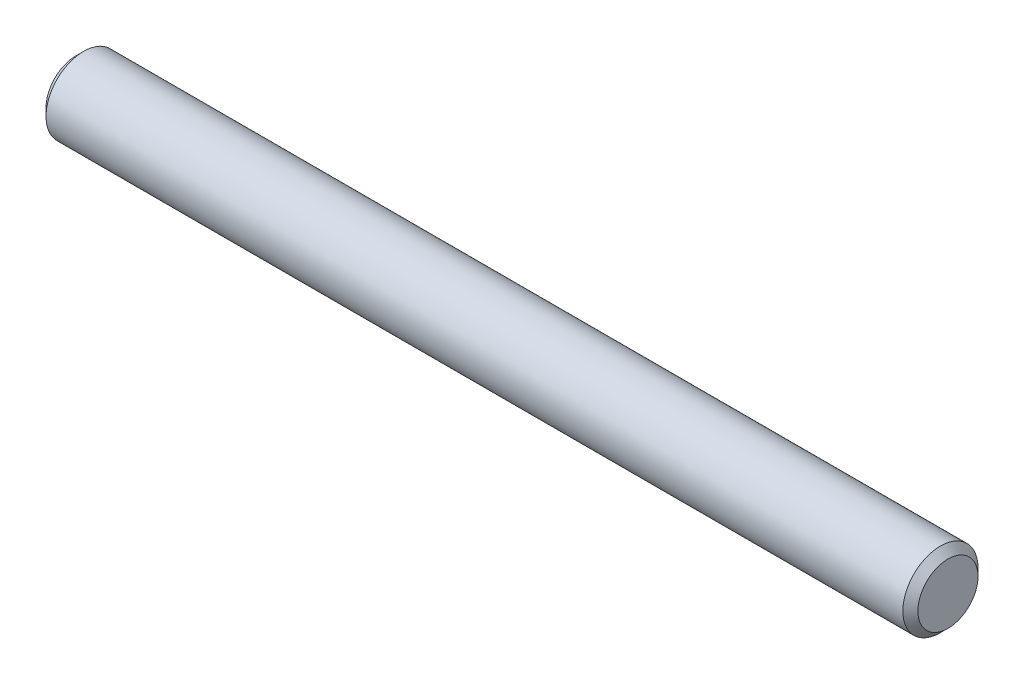
ISO-10303-21;
HEADER;
FILE_DESCRIPTION(('STEP AP214'),'2;1');
FILE_NAME('part.step','',(''),(''),'','','');
FILE_SCHEMA(('AUTOMOTIVE_DESIGN { 1 0 10303 214 1 1 1 1 }'));
ENDSEC;
DATA;
#1=APPLICATION_CONTEXT('core data for automotive mechanical design processes');
#2=APPLICATION_PROTOCOL_DEFINITION('international standard','automotive_design',2000,#1);
#3=PRODUCT_CONTEXT('',#1,'mechanical');
#4=PRODUCT('Part','Part','',(#3));
#5=PRODUCT_RELATED_PRODUCT_CATEGORY('part','',(#4));
#6=PRODUCT_DEFINITION_FORMATION('','',#4);
#7=PRODUCT_DEFINITION_CONTEXT('part definition',#1,'design');
#8=PRODUCT_DEFINITION('design','',#6,#7);
#9=PRODUCT_DEFINITION_SHAPE('','',#8);
#10=(LENGTH_UNIT() NAMED_UNIT(*) SI_UNIT(.MILLI.,.METRE.));
#11=(NAMED_UNIT(*) PLANE_ANGLE_UNIT() SI_UNIT($,.RADIAN.));
#12=(NAMED_UNIT(*) SI_UNIT($,.STERADIAN.) SOLID_ANGLE_UNIT());
#13=UNCERTAINTY_MEASURE_WITH_UNIT(LENGTH_MEASURE(1.E-05),#10,'distance_accuracy_value','');
#14=(GEOMETRIC_REPRESENTATION_CONTEXT(3) GLOBAL_UNCERTAINTY_ASSIGNED_CONTEXT((#13)) GLOBAL_UNIT_ASSIGNED_CONTEXT((#10,
#11,#12)) REPRESENTATION_CONTEXT('',''));
#15=CARTESIAN_POINT('',(0.,0.,0.));
#16=DIRECTION('',(0.,0.,1.));
#17=DIRECTION('',(1.,0.,0.));
#18=AXIS2_PLACEMENT_3D('',#15,#16,#17);
#19=CARTESIAN_POINT('',(116.,0.,0.));
#20=DIRECTION('',(-1.,0.,0.));
#21=DIRECTION('',(0.,0.,1.));
#22=AXIS2_PLACEMENT_3D('',#19,#20,#21);
#23=CYLINDRICAL_SURFACE('',#22,5.);
#24=CARTESIAN_POINT('',(115.,0.,0.));
#25=DIRECTION('',(1.,0.,0.));
#26=DIRECTION('',(0.,0.,-1.));
#27=AXIS2_PLACEMENT_3D('',#24,#25,#26);
#28=CIRCLE('',#27,5.);
#29=CARTESIAN_POINT('',(115.,0.,-5.));
#30=VERTEX_POINT('',#29);
#31=EDGE_CURVE('E38',#30,#30,#28,.F.);
#32=ORIENTED_EDGE('',*,*,#31,.T.);
#33=EDGE_LOOP('',(#32));
#34=FACE_BOUND('',#33,.T.);
#35=CARTESIAN_POINT('',(1.00000000000006,0.,0.));
#36=DIRECTION('',(1.,0.,0.));
#37=DIRECTION('',(0.,0.,-1.));
#38=AXIS2_PLACEMENT_3D('',#35,#36,#37);
#39=CIRCLE('',#38,5.);
#40=CARTESIAN_POINT('',(1.00000000000006,0.,-5.));
#41=VERTEX_POINT('',#40);
#42=EDGE_CURVE('E42',#41,#41,#39,.T.);
#43=ORIENTED_EDGE('',*,*,#42,.T.);
#44=EDGE_LOOP('',(#43));
#45=FACE_BOUND('',#44,.T.);
#46=ADVANCED_FACE('F31',(#34,#45),#23,.T.);
#47=CARTESIAN_POINT('',(116.,0.,0.));
#48=DIRECTION('',(1.,0.,0.));
#49=DIRECTION('',(0.,0.,-1.));
#50=AXIS2_PLACEMENT_3D('',#47,#48,#49);
#51=PLANE('',#50);
#52=CARTESIAN_POINT('',(116.,0.,0.));
#53=DIRECTION('',(1.,0.,0.));
#54=DIRECTION('',(0.,0.,-1.));
#55=AXIS2_PLACEMENT_3D('',#52,#53,#54);
#56=CIRCLE('',#55,4.00000000000003);
#57=CARTESIAN_POINT('',(116.,0.,-4.00000000000003));
#58=VERTEX_POINT('',#57);
#59=EDGE_CURVE('E46',#58,#58,#56,.T.);
#60=ORIENTED_EDGE('',*,*,#59,.T.);
#61=EDGE_LOOP('',(#60));
#62=FACE_BOUND('',#61,.T.);
#63=ADVANCED_FACE('F52',(#62),#51,.T.);
#64=CARTESIAN_POINT('',(0.,0.,0.));
#65=DIRECTION('',(1.,0.,0.));
#66=DIRECTION('',(0.,0.,-1.));
#67=AXIS2_PLACEMENT_3D('',#64,#65,#66);
#68=PLANE('',#67);
#69=CARTESIAN_POINT('',(0.,0.,0.));
#70=DIRECTION('',(1.,0.,0.));
#71=DIRECTION('',(0.,0.,-1.));
#72=AXIS2_PLACEMENT_3D('',#69,#70,#71);
#73=CIRCLE('',#72,3.99999999999993);
#74=CARTESIAN_POINT('',(0.,0.,-3.99999999999993));
#75=VERTEX_POINT('',#74);
#76=EDGE_CURVE('E10',#75,#75,#73,.F.);
#77=ORIENTED_EDGE('',*,*,#76,.T.);
#78=EDGE_LOOP('',(#77));
#79=FACE_BOUND('',#78,.T.);
#80=ADVANCED_FACE('F56',(#79),#68,.F.);
#81=CARTESIAN_POINT('',(116.,0.,0.));
#82=DIRECTION('',(-1.,0.,0.));
#83=DIRECTION('',(0.,0.,1.));
#84=AXIS2_PLACEMENT_3D('',#81,#82,#83);
#85=CONICAL_SURFACE('',#84,4.00000000000003,0.785398163397446);
#86=ORIENTED_EDGE('',*,*,#31,.F.);
#87=EDGE_LOOP('',(#86));
#88=FACE_BOUND('',#87,.T.);
#89=ORIENTED_EDGE('',*,*,#59,.F.);
#90=EDGE_LOOP('',(#89));
#91=FACE_BOUND('',#90,.T.);
#92=ADVANCED_FACE('F54',(#88,#91),#85,.T.);
#93=CARTESIAN_POINT('',(1.00000000000006,0.,0.));
#94=DIRECTION('',(1.,0.,0.));
#95=DIRECTION('',(0.,0.,-1.));
#96=AXIS2_PLACEMENT_3D('',#93,#94,#95);
#97=CONICAL_SURFACE('',#96,5.,0.785398163397453);
#98=ORIENTED_EDGE('',*,*,#76,.F.);
#99=EDGE_LOOP('',(#98));
#100=FACE_BOUND('',#99,.T.);
#101=ORIENTED_EDGE('',*,*,#42,.F.);
#102=EDGE_LOOP('',(#101));
#103=FACE_BOUND('',#102,.T.);
#104=ADVANCED_FACE('F33',(#100,#103),#97,.T.);
#105=CLOSED_SHELL('',(#46,#63,#80,#92,#104));
#106=MANIFOLD_SOLID_BREP('B2',#105);
#107=ADVANCED_BREP_SHAPE_REPRESENTATION('',(#18,#106),#14);
#108=SHAPE_DEFINITION_REPRESENTATION(#9,#107);
ENDSEC;
END-ISO-10303-21;
